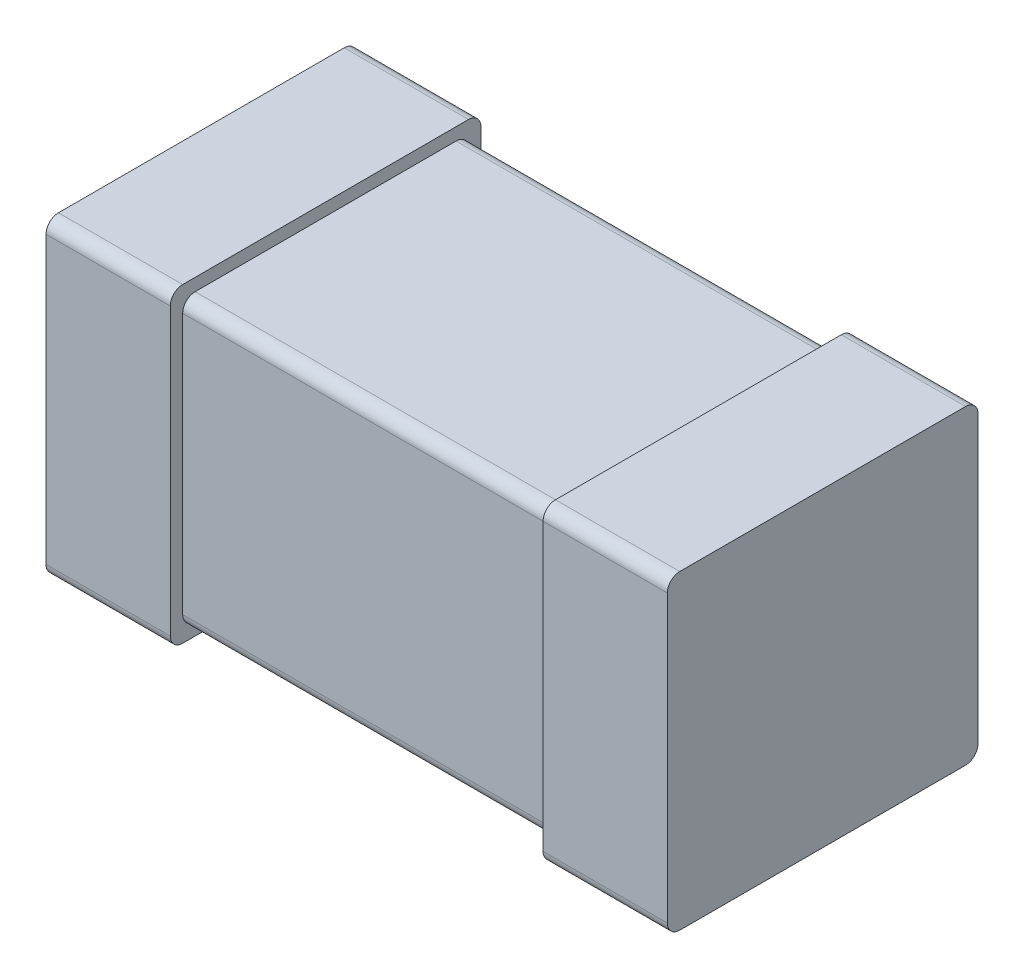
ISO-10303-21;
HEADER;
FILE_DESCRIPTION(('STEP AP214'),'2;1');
FILE_NAME('part.step','',(''),(''),'','','');
FILE_SCHEMA(('AUTOMOTIVE_DESIGN { 1 0 10303 214 1 1 1 1 }'));
ENDSEC;
DATA;
#1=APPLICATION_CONTEXT('core data for automotive mechanical design processes');
#2=APPLICATION_PROTOCOL_DEFINITION('international standard','automotive_design',2000,#1);
#3=PRODUCT_CONTEXT('',#1,'mechanical');
#4=PRODUCT('Part','Part','',(#3));
#5=PRODUCT_RELATED_PRODUCT_CATEGORY('part','',(#4));
#6=PRODUCT_DEFINITION_FORMATION('','',#4);
#7=PRODUCT_DEFINITION_CONTEXT('part definition',#1,'design');
#8=PRODUCT_DEFINITION('design','',#6,#7);
#9=PRODUCT_DEFINITION_SHAPE('','',#8);
#10=(LENGTH_UNIT() NAMED_UNIT(*) SI_UNIT(.MILLI.,.METRE.));
#11=(NAMED_UNIT(*) PLANE_ANGLE_UNIT() SI_UNIT($,.RADIAN.));
#12=(NAMED_UNIT(*) SI_UNIT($,.STERADIAN.) SOLID_ANGLE_UNIT());
#13=UNCERTAINTY_MEASURE_WITH_UNIT(LENGTH_MEASURE(1.E-05),#10,'distance_accuracy_value','');
#14=(GEOMETRIC_REPRESENTATION_CONTEXT(3) GLOBAL_UNCERTAINTY_ASSIGNED_CONTEXT((#13)) GLOBAL_UNIT_ASSIGNED_CONTEXT((#10,
#11,#12)) REPRESENTATION_CONTEXT('',''));
#15=CARTESIAN_POINT('',(0.,0.,0.));
#16=DIRECTION('',(0.,0.,1.));
#17=DIRECTION('',(1.,0.,0.));
#18=AXIS2_PLACEMENT_3D('',#15,#16,#17);
#19=CARTESIAN_POINT('',(-0.5,-0.25,0.));
#20=DIRECTION('',(1.,0.,0.));
#21=DIRECTION('',(0.,0.,1.));
#22=AXIS2_PLACEMENT_3D('',#19,#20,#21);
#23=PLANE('',#22);
#24=CARTESIAN_POINT('',(-0.5,-0.23,0.48));
#25=DIRECTION('',(-1.,0.,0.));
#26=DIRECTION('',(0.,0.,1.));
#27=AXIS2_PLACEMENT_3D('',#24,#25,#26);
#28=CIRCLE('',#27,0.02);
#29=CARTESIAN_POINT('',(-0.5,-0.25,0.48));
#30=VERTEX_POINT('',#29);
#31=CARTESIAN_POINT('',(-0.5,-0.23,0.5));
#32=VERTEX_POINT('',#31);
#33=EDGE_CURVE('E11',#30,#32,#28,.T.);
#34=ORIENTED_EDGE('',*,*,#33,.T.);
#35=DIRECTION('',(0.,1.,0.));
#36=VECTOR('',#35,1.);
#37=CARTESIAN_POINT('',(-0.5,-0.25,0.5));
#38=LINE('',#37,#36);
#39=CARTESIAN_POINT('',(-0.5,0.23,0.5));
#40=VERTEX_POINT('',#39);
#41=EDGE_CURVE('E25',#32,#40,#38,.T.);
#42=ORIENTED_EDGE('',*,*,#41,.T.);
#43=CARTESIAN_POINT('',(-0.5,0.23,0.48));
#44=DIRECTION('',(1.,0.,0.));
#45=DIRECTION('',(0.,0.,1.));
#46=AXIS2_PLACEMENT_3D('',#43,#44,#45);
#47=CIRCLE('',#46,0.02);
#48=CARTESIAN_POINT('',(-0.5,0.25,0.48));
#49=VERTEX_POINT('',#48);
#50=EDGE_CURVE('E450',#49,#40,#47,.T.);
#51=ORIENTED_EDGE('',*,*,#50,.F.);
#52=DIRECTION('',(0.,0.,1.));
#53=VECTOR('',#52,1.);
#54=CARTESIAN_POINT('',(-0.5,0.25,0.));
#55=LINE('',#54,#53);
#56=CARTESIAN_POINT('',(-0.5,0.25,0.02));
#57=VERTEX_POINT('',#56);
#58=EDGE_CURVE('E445',#57,#49,#55,.T.);
#59=ORIENTED_EDGE('',*,*,#58,.F.);
#60=CARTESIAN_POINT('',(-0.5,0.23,0.02));
#61=DIRECTION('',(-1.,0.,0.));
#62=DIRECTION('',(0.,0.,1.));
#63=AXIS2_PLACEMENT_3D('',#60,#61,#62);
#64=CIRCLE('',#63,0.02);
#65=CARTESIAN_POINT('',(-0.5,0.23,0.));
#66=VERTEX_POINT('',#65);
#67=EDGE_CURVE('E441',#57,#66,#64,.T.);
#68=ORIENTED_EDGE('',*,*,#67,.T.);
#69=DIRECTION('',(0.,1.,0.));
#70=VECTOR('',#69,1.);
#71=CARTESIAN_POINT('',(-0.5,-0.25,0.));
#72=LINE('',#71,#70);
#73=CARTESIAN_POINT('',(-0.5,-0.23,0.));
#74=VERTEX_POINT('',#73);
#75=EDGE_CURVE('E436',#74,#66,#72,.T.);
#76=ORIENTED_EDGE('',*,*,#75,.F.);
#77=CARTESIAN_POINT('',(-0.5,-0.23,0.02));
#78=DIRECTION('',(1.,0.,0.));
#79=DIRECTION('',(0.,0.,1.));
#80=AXIS2_PLACEMENT_3D('',#77,#78,#79);
#81=CIRCLE('',#80,0.02);
#82=CARTESIAN_POINT('',(-0.5,-0.25,0.02));
#83=VERTEX_POINT('',#82);
#84=EDGE_CURVE('E431',#83,#74,#81,.T.);
#85=ORIENTED_EDGE('',*,*,#84,.F.);
#86=DIRECTION('',(0.,0.,1.));
#87=VECTOR('',#86,1.);
#88=CARTESIAN_POINT('',(-0.5,-0.25,0.));
#89=LINE('',#88,#87);
#90=EDGE_CURVE('E427',#83,#30,#89,.T.);
#91=ORIENTED_EDGE('',*,*,#90,.T.);
#92=EDGE_LOOP('',(#34,#42,#51,#59,#68,#76,#85,#91));
#93=FACE_BOUND('',#92,.T.);
#94=ADVANCED_FACE('F17',(#93),#23,.F.);
#95=CARTESIAN_POINT('',(-0.5,-0.25,0.));
#96=DIRECTION('',(0.,1.,0.));
#97=DIRECTION('',(0.,0.,1.));
#98=AXIS2_PLACEMENT_3D('',#95,#96,#97);
#99=PLANE('',#98);
#100=DIRECTION('',(1.,0.,0.));
#101=VECTOR('',#100,1.);
#102=CARTESIAN_POINT('',(-0.5,-0.25,0.48));
#103=LINE('',#102,#101);
#104=CARTESIAN_POINT('',(-0.3,-0.25,0.48));
#105=VERTEX_POINT('',#104);
#106=EDGE_CURVE('E422',#30,#105,#103,.T.);
#107=ORIENTED_EDGE('',*,*,#106,.F.);
#108=ORIENTED_EDGE('',*,*,#90,.F.);
#109=DIRECTION('',(1.,0.,0.));
#110=VECTOR('',#109,1.);
#111=CARTESIAN_POINT('',(-0.5,-0.25,0.02));
#112=LINE('',#111,#110);
#113=CARTESIAN_POINT('',(-0.3,-0.25,0.02));
#114=VERTEX_POINT('',#113);
#115=EDGE_CURVE('E418',#83,#114,#112,.T.);
#116=ORIENTED_EDGE('',*,*,#115,.T.);
#117=DIRECTION('',(0.,0.,1.));
#118=VECTOR('',#117,1.);
#119=CARTESIAN_POINT('',(-0.3,-0.25,0.));
#120=LINE('',#119,#118);
#121=EDGE_CURVE('E414',#114,#105,#120,.T.);
#122=ORIENTED_EDGE('',*,*,#121,.T.);
#123=EDGE_LOOP('',(#107,#108,#116,#122));
#124=FACE_BOUND('',#123,.T.);
#125=ADVANCED_FACE('F495',(#124),#99,.F.);
#126=CARTESIAN_POINT('',(-0.3,-0.25,0.));
#127=DIRECTION('',(1.,0.,0.));
#128=DIRECTION('',(0.,0.,1.));
#129=AXIS2_PLACEMENT_3D('',#126,#127,#128);
#130=PLANE('',#129);
#131=ORIENTED_EDGE('',*,*,#121,.F.);
#132=CARTESIAN_POINT('',(-0.3,-0.23,0.02));
#133=DIRECTION('',(1.,0.,0.));
#134=DIRECTION('',(0.,0.,1.));
#135=AXIS2_PLACEMENT_3D('',#132,#133,#134);
#136=CIRCLE('',#135,0.02);
#137=CARTESIAN_POINT('',(-0.3,-0.23,0.));
#138=VERTEX_POINT('',#137);
#139=EDGE_CURVE('E410',#114,#138,#136,.T.);
#140=ORIENTED_EDGE('',*,*,#139,.T.);
#141=DIRECTION('',(0.,1.,0.));
#142=VECTOR('',#141,1.);
#143=CARTESIAN_POINT('',(-0.3,-0.25,0.));
#144=LINE('',#143,#142);
#145=CARTESIAN_POINT('',(-0.3,0.23,0.));
#146=VERTEX_POINT('',#145);
#147=EDGE_CURVE('E406',#138,#146,#144,.T.);
#148=ORIENTED_EDGE('',*,*,#147,.T.);
#149=CARTESIAN_POINT('',(-0.3,0.23,0.02));
#150=DIRECTION('',(-1.,0.,0.));
#151=DIRECTION('',(0.,0.,1.));
#152=AXIS2_PLACEMENT_3D('',#149,#150,#151);
#153=CIRCLE('',#152,0.02);
#154=CARTESIAN_POINT('',(-0.3,0.25,0.02));
#155=VERTEX_POINT('',#154);
#156=EDGE_CURVE('E401',#155,#146,#153,.T.);
#157=ORIENTED_EDGE('',*,*,#156,.F.);
#158=DIRECTION('',(0.,0.,1.));
#159=VECTOR('',#158,1.);
#160=CARTESIAN_POINT('',(-0.3,0.25,0.));
#161=LINE('',#160,#159);
#162=CARTESIAN_POINT('',(-0.3,0.25,0.48));
#163=VERTEX_POINT('',#162);
#164=EDGE_CURVE('E397',#155,#163,#161,.T.);
#165=ORIENTED_EDGE('',*,*,#164,.T.);
#166=CARTESIAN_POINT('',(-0.3,0.23,0.48));
#167=DIRECTION('',(1.,0.,0.));
#168=DIRECTION('',(0.,0.,1.));
#169=AXIS2_PLACEMENT_3D('',#166,#167,#168);
#170=CIRCLE('',#169,0.02);
#171=CARTESIAN_POINT('',(-0.3,0.23,0.5));
#172=VERTEX_POINT('',#171);
#173=EDGE_CURVE('E393',#163,#172,#170,.T.);
#174=ORIENTED_EDGE('',*,*,#173,.T.);
#175=DIRECTION('',(0.,1.,0.));
#176=VECTOR('',#175,1.);
#177=CARTESIAN_POINT('',(-0.3,-0.25,0.5));
#178=LINE('',#177,#176);
#179=CARTESIAN_POINT('',(-0.3,-0.23,0.5));
#180=VERTEX_POINT('',#179);
#181=EDGE_CURVE('E388',#180,#172,#178,.T.);
#182=ORIENTED_EDGE('',*,*,#181,.F.);
#183=CARTESIAN_POINT('',(-0.3,-0.23,0.48));
#184=DIRECTION('',(-1.,0.,0.));
#185=DIRECTION('',(0.,0.,1.));
#186=AXIS2_PLACEMENT_3D('',#183,#184,#185);
#187=CIRCLE('',#186,0.02);
#188=EDGE_CURVE('E383',#105,#180,#187,.T.);
#189=ORIENTED_EDGE('',*,*,#188,.F.);
#190=EDGE_LOOP('',(#131,#140,#148,#157,#165,#174,#182,#189));
#191=FACE_BOUND('',#190,.T.);
#192=CARTESIAN_POINT('',(-0.3,-0.21,0.04));
#193=DIRECTION('',(1.,0.,0.));
#194=DIRECTION('',(0.,0.,1.));
#195=AXIS2_PLACEMENT_3D('',#192,#193,#194);
#196=CIRCLE('',#195,0.02);
#197=CARTESIAN_POINT('',(-0.3,-0.23,0.04));
#198=VERTEX_POINT('',#197);
#199=CARTESIAN_POINT('',(-0.3,-0.21,0.02));
#200=VERTEX_POINT('',#199);
#201=EDGE_CURVE('E378',#198,#200,#196,.T.);
#202=ORIENTED_EDGE('',*,*,#201,.F.);
#203=DIRECTION('',(0.,0.,1.));
#204=VECTOR('',#203,1.);
#205=CARTESIAN_POINT('',(-0.3,-0.23,0.02));
#206=LINE('',#205,#204);
#207=CARTESIAN_POINT('',(-0.3,-0.23,0.46));
#208=VERTEX_POINT('',#207);
#209=EDGE_CURVE('E374',#198,#208,#206,.T.);
#210=ORIENTED_EDGE('',*,*,#209,.T.);
#211=CARTESIAN_POINT('',(-0.3,-0.21,0.46));
#212=DIRECTION('',(-1.,0.,0.));
#213=DIRECTION('',(0.,0.,1.));
#214=AXIS2_PLACEMENT_3D('',#211,#212,#213);
#215=CIRCLE('',#214,0.02);
#216=CARTESIAN_POINT('',(-0.3,-0.21,0.48));
#217=VERTEX_POINT('',#216);
#218=EDGE_CURVE('E370',#208,#217,#215,.T.);
#219=ORIENTED_EDGE('',*,*,#218,.T.);
#220=DIRECTION('',(0.,1.,0.));
#221=VECTOR('',#220,1.);
#222=CARTESIAN_POINT('',(-0.3,-0.23,0.48));
#223=LINE('',#222,#221);
#224=CARTESIAN_POINT('',(-0.3,0.21,0.48));
#225=VERTEX_POINT('',#224);
#226=EDGE_CURVE('E366',#217,#225,#223,.T.);
#227=ORIENTED_EDGE('',*,*,#226,.T.);
#228=CARTESIAN_POINT('',(-0.3,0.21,0.46));
#229=DIRECTION('',(1.,0.,0.));
#230=DIRECTION('',(0.,0.,1.));
#231=AXIS2_PLACEMENT_3D('',#228,#229,#230);
#232=CIRCLE('',#231,0.02);
#233=CARTESIAN_POINT('',(-0.3,0.23,0.46));
#234=VERTEX_POINT('',#233);
#235=EDGE_CURVE('E361',#234,#225,#232,.T.);
#236=ORIENTED_EDGE('',*,*,#235,.F.);
#237=DIRECTION('',(0.,0.,1.));
#238=VECTOR('',#237,1.);
#239=CARTESIAN_POINT('',(-0.3,0.23,0.02));
#240=LINE('',#239,#238);
#241=CARTESIAN_POINT('',(-0.3,0.23,0.04));
#242=VERTEX_POINT('',#241);
#243=EDGE_CURVE('E356',#242,#234,#240,.T.);
#244=ORIENTED_EDGE('',*,*,#243,.F.);
#245=CARTESIAN_POINT('',(-0.3,0.21,0.04));
#246=DIRECTION('',(-1.,0.,0.));
#247=DIRECTION('',(0.,0.,1.));
#248=AXIS2_PLACEMENT_3D('',#245,#246,#247);
#249=CIRCLE('',#248,0.02);
#250=CARTESIAN_POINT('',(-0.3,0.21,0.02));
#251=VERTEX_POINT('',#250);
#252=EDGE_CURVE('E352',#242,#251,#249,.T.);
#253=ORIENTED_EDGE('',*,*,#252,.T.);
#254=DIRECTION('',(0.,1.,0.));
#255=VECTOR('',#254,1.);
#256=CARTESIAN_POINT('',(-0.3,-0.23,0.02));
#257=LINE('',#256,#255);
#258=EDGE_CURVE('E347',#200,#251,#257,.T.);
#259=ORIENTED_EDGE('',*,*,#258,.F.);
#260=EDGE_LOOP('',(#202,#210,#219,#227,#236,#244,#253,#259));
#261=FACE_BOUND('',#260,.T.);
#262=ADVANCED_FACE('F573',(#191,#261),#130,.T.);
#263=CARTESIAN_POINT('',(-0.3,-0.23,0.02));
#264=DIRECTION('',(0.,0.,1.));
#265=DIRECTION('',(1.,0.,0.));
#266=AXIS2_PLACEMENT_3D('',#263,#264,#265);
#267=PLANE('',#266);
#268=DIRECTION('',(1.,0.,0.));
#269=VECTOR('',#268,1.);
#270=CARTESIAN_POINT('',(-0.3,0.21,0.02));
#271=LINE('',#270,#269);
#272=CARTESIAN_POINT('',(0.3,0.21,0.02));
#273=VERTEX_POINT('',#272);
#274=EDGE_CURVE('E343',#251,#273,#271,.T.);
#275=ORIENTED_EDGE('',*,*,#274,.T.);
#276=DIRECTION('',(0.,1.,0.));
#277=VECTOR('',#276,1.);
#278=CARTESIAN_POINT('',(0.3,-0.23,0.02));
#279=LINE('',#278,#277);
#280=CARTESIAN_POINT('',(0.3,-0.21,0.02));
#281=VERTEX_POINT('',#280);
#282=EDGE_CURVE('E338',#281,#273,#279,.T.);
#283=ORIENTED_EDGE('',*,*,#282,.F.);
#284=DIRECTION('',(1.,0.,0.));
#285=VECTOR('',#284,1.);
#286=CARTESIAN_POINT('',(-0.3,-0.21,0.02));
#287=LINE('',#286,#285);
#288=EDGE_CURVE('E333',#200,#281,#287,.T.);
#289=ORIENTED_EDGE('',*,*,#288,.F.);
#290=ORIENTED_EDGE('',*,*,#258,.T.);
#291=EDGE_LOOP('',(#275,#283,#289,#290));
#292=FACE_BOUND('',#291,.T.);
#293=ADVANCED_FACE('F577',(#292),#267,.F.);
#294=CARTESIAN_POINT('',(-0.3,-0.21,0.04));
#295=DIRECTION('',(1.,0.,0.));
#296=DIRECTION('',(0.,0.707106781186547,0.707106781186548));
#297=AXIS2_PLACEMENT_3D('',#294,#295,#296);
#298=CYLINDRICAL_SURFACE('',#297,0.02);
#299=ORIENTED_EDGE('',*,*,#201,.T.);
#300=ORIENTED_EDGE('',*,*,#288,.T.);
#301=CARTESIAN_POINT('',(0.3,-0.21,0.04));
#302=DIRECTION('',(1.,0.,0.));
#303=DIRECTION('',(0.,0.,1.));
#304=AXIS2_PLACEMENT_3D('',#301,#302,#303);
#305=CIRCLE('',#304,0.02);
#306=CARTESIAN_POINT('',(0.3,-0.23,0.04));
#307=VERTEX_POINT('',#306);
#308=EDGE_CURVE('E328',#307,#281,#305,.T.);
#309=ORIENTED_EDGE('',*,*,#308,.F.);
#310=DIRECTION('',(1.,0.,0.));
#311=VECTOR('',#310,1.);
#312=CARTESIAN_POINT('',(-0.3,-0.23,0.04));
#313=LINE('',#312,#311);
#314=EDGE_CURVE('E323',#198,#307,#313,.T.);
#315=ORIENTED_EDGE('',*,*,#314,.F.);
#316=EDGE_LOOP('',(#299,#300,#309,#315));
#317=FACE_BOUND('',#316,.T.);
#318=ADVANCED_FACE('F583',(#317),#298,.T.);
#319=CARTESIAN_POINT('',(-0.3,-0.23,0.02));
#320=DIRECTION('',(0.,1.,0.));
#321=DIRECTION('',(0.,0.,1.));
#322=AXIS2_PLACEMENT_3D('',#319,#320,#321);
#323=PLANE('',#322);
#324=DIRECTION('',(1.,0.,0.));
#325=VECTOR('',#324,1.);
#326=CARTESIAN_POINT('',(-0.3,-0.23,0.46));
#327=LINE('',#326,#325);
#328=CARTESIAN_POINT('',(0.3,-0.23,0.46));
#329=VERTEX_POINT('',#328);
#330=EDGE_CURVE('E318',#208,#329,#327,.T.);
#331=ORIENTED_EDGE('',*,*,#330,.F.);
#332=ORIENTED_EDGE('',*,*,#209,.F.);
#333=ORIENTED_EDGE('',*,*,#314,.T.);
#334=DIRECTION('',(0.,0.,1.));
#335=VECTOR('',#334,1.);
#336=CARTESIAN_POINT('',(0.3,-0.23,0.02));
#337=LINE('',#336,#335);
#338=EDGE_CURVE('E314',#307,#329,#337,.T.);
#339=ORIENTED_EDGE('',*,*,#338,.T.);
#340=EDGE_LOOP('',(#331,#332,#333,#339));
#341=FACE_BOUND('',#340,.T.);
#342=ADVANCED_FACE('F587',(#341),#323,.F.);
#343=CARTESIAN_POINT('',(0.3,-0.25,0.));
#344=DIRECTION('',(1.,0.,0.));
#345=DIRECTION('',(0.,0.,1.));
#346=AXIS2_PLACEMENT_3D('',#343,#344,#345);
#347=PLANE('',#346);
#348=CARTESIAN_POINT('',(0.3,-0.23,0.48));
#349=DIRECTION('',(-1.,0.,0.));
#350=DIRECTION('',(0.,0.,1.));
#351=AXIS2_PLACEMENT_3D('',#348,#349,#350);
#352=CIRCLE('',#351,0.02);
#353=CARTESIAN_POINT('',(0.3,-0.25,0.48));
#354=VERTEX_POINT('',#353);
#355=CARTESIAN_POINT('',(0.3,-0.23,0.5));
#356=VERTEX_POINT('',#355);
#357=EDGE_CURVE('E310',#354,#356,#352,.T.);
#358=ORIENTED_EDGE('',*,*,#357,.T.);
#359=DIRECTION('',(0.,1.,0.));
#360=VECTOR('',#359,1.);
#361=CARTESIAN_POINT('',(0.3,-0.25,0.5));
#362=LINE('',#361,#360);
#363=CARTESIAN_POINT('',(0.3,0.23,0.5));
#364=VERTEX_POINT('',#363);
#365=EDGE_CURVE('E191',#356,#364,#362,.T.);
#366=ORIENTED_EDGE('',*,*,#365,.T.);
#367=CARTESIAN_POINT('',(0.3,0.23,0.48));
#368=DIRECTION('',(1.,0.,0.));
#369=DIRECTION('',(0.,0.,1.));
#370=AXIS2_PLACEMENT_3D('',#367,#368,#369);
#371=CIRCLE('',#370,0.02);
#372=CARTESIAN_POINT('',(0.3,0.25,0.48));
#373=VERTEX_POINT('',#372);
#374=EDGE_CURVE('E302',#373,#364,#371,.T.);
#375=ORIENTED_EDGE('',*,*,#374,.F.);
#376=DIRECTION('',(0.,0.,1.));
#377=VECTOR('',#376,1.);
#378=CARTESIAN_POINT('',(0.3,0.25,0.));
#379=LINE('',#378,#377);
#380=CARTESIAN_POINT('',(0.3,0.25,0.02));
#381=VERTEX_POINT('',#380);
#382=EDGE_CURVE('E297',#381,#373,#379,.T.);
#383=ORIENTED_EDGE('',*,*,#382,.F.);
#384=CARTESIAN_POINT('',(0.3,0.23,0.02));
#385=DIRECTION('',(-1.,0.,0.));
#386=DIRECTION('',(0.,0.,1.));
#387=AXIS2_PLACEMENT_3D('',#384,#385,#386);
#388=CIRCLE('',#387,0.02);
#389=CARTESIAN_POINT('',(0.3,0.23,0.));
#390=VERTEX_POINT('',#389);
#391=EDGE_CURVE('E293',#381,#390,#388,.T.);
#392=ORIENTED_EDGE('',*,*,#391,.T.);
#393=DIRECTION('',(0.,1.,0.));
#394=VECTOR('',#393,1.);
#395=CARTESIAN_POINT('',(0.3,-0.25,0.));
#396=LINE('',#395,#394);
#397=CARTESIAN_POINT('',(0.3,-0.23,0.));
#398=VERTEX_POINT('',#397);
#399=EDGE_CURVE('E288',#398,#390,#396,.T.);
#400=ORIENTED_EDGE('',*,*,#399,.F.);
#401=CARTESIAN_POINT('',(0.3,-0.23,0.02));
#402=DIRECTION('',(1.,0.,0.));
#403=DIRECTION('',(0.,0.,1.));
#404=AXIS2_PLACEMENT_3D('',#401,#402,#403);
#405=CIRCLE('',#404,0.02);
#406=CARTESIAN_POINT('',(0.3,-0.25,0.02));
#407=VERTEX_POINT('',#406);
#408=EDGE_CURVE('E283',#407,#398,#405,.T.);
#409=ORIENTED_EDGE('',*,*,#408,.F.);
#410=DIRECTION('',(0.,0.,1.));
#411=VECTOR('',#410,1.);
#412=CARTESIAN_POINT('',(0.3,-0.25,0.));
#413=LINE('',#412,#411);
#414=EDGE_CURVE('E279',#407,#354,#413,.T.);
#415=ORIENTED_EDGE('',*,*,#414,.T.);
#416=EDGE_LOOP('',(#358,#366,#375,#383,#392,#400,#409,#415));
#417=FACE_BOUND('',#416,.T.);
#418=ORIENTED_EDGE('',*,*,#282,.T.);
#419=CARTESIAN_POINT('',(0.3,0.21,0.04));
#420=DIRECTION('',(-1.,0.,0.));
#421=DIRECTION('',(0.,0.,1.));
#422=AXIS2_PLACEMENT_3D('',#419,#420,#421);
#423=CIRCLE('',#422,0.02);
#424=CARTESIAN_POINT('',(0.3,0.23,0.04));
#425=VERTEX_POINT('',#424);
#426=EDGE_CURVE('E274',#425,#273,#423,.T.);
#427=ORIENTED_EDGE('',*,*,#426,.F.);
#428=DIRECTION('',(0.,0.,1.));
#429=VECTOR('',#428,1.);
#430=CARTESIAN_POINT('',(0.3,0.23,0.02));
#431=LINE('',#430,#429);
#432=CARTESIAN_POINT('',(0.3,0.23,0.46));
#433=VERTEX_POINT('',#432);
#434=EDGE_CURVE('E270',#425,#433,#431,.T.);
#435=ORIENTED_EDGE('',*,*,#434,.T.);
#436=CARTESIAN_POINT('',(0.3,0.21,0.46));
#437=DIRECTION('',(1.,0.,0.));
#438=DIRECTION('',(0.,0.,1.));
#439=AXIS2_PLACEMENT_3D('',#436,#437,#438);
#440=CIRCLE('',#439,0.02);
#441=CARTESIAN_POINT('',(0.3,0.21,0.48));
#442=VERTEX_POINT('',#441);
#443=EDGE_CURVE('E266',#433,#442,#440,.T.);
#444=ORIENTED_EDGE('',*,*,#443,.T.);
#445=DIRECTION('',(0.,1.,0.));
#446=VECTOR('',#445,1.);
#447=CARTESIAN_POINT('',(0.3,-0.23,0.48));
#448=LINE('',#447,#446);
#449=CARTESIAN_POINT('',(0.3,-0.21,0.48));
#450=VERTEX_POINT('',#449);
#451=EDGE_CURVE('E261',#450,#442,#448,.T.);
#452=ORIENTED_EDGE('',*,*,#451,.F.);
#453=CARTESIAN_POINT('',(0.3,-0.21,0.46));
#454=DIRECTION('',(-1.,0.,0.));
#455=DIRECTION('',(0.,0.,1.));
#456=AXIS2_PLACEMENT_3D('',#453,#454,#455);
#457=CIRCLE('',#456,0.02);
#458=EDGE_CURVE('E256',#329,#450,#457,.T.);
#459=ORIENTED_EDGE('',*,*,#458,.F.);
#460=ORIENTED_EDGE('',*,*,#338,.F.);
#461=ORIENTED_EDGE('',*,*,#308,.T.);
#462=EDGE_LOOP('',(#418,#427,#435,#444,#452,#459,#460,#461));
#463=FACE_BOUND('',#462,.T.);
#464=ADVANCED_FACE('F539',(#417,#463),#347,.F.);
#465=CARTESIAN_POINT('',(-0.3,-0.21,0.46));
#466=DIRECTION('',(1.,0.,0.));
#467=DIRECTION('',(0.,0.707106781186547,-0.707106781186548));
#468=AXIS2_PLACEMENT_3D('',#465,#466,#467);
#469=CYLINDRICAL_SURFACE('',#468,0.02);
#470=ORIENTED_EDGE('',*,*,#330,.T.);
#471=ORIENTED_EDGE('',*,*,#458,.T.);
#472=DIRECTION('',(1.,0.,0.));
#473=VECTOR('',#472,1.);
#474=CARTESIAN_POINT('',(-0.3,-0.21,0.48));
#475=LINE('',#474,#473);
#476=EDGE_CURVE('E251',#217,#450,#475,.T.);
#477=ORIENTED_EDGE('',*,*,#476,.F.);
#478=ORIENTED_EDGE('',*,*,#218,.F.);
#479=EDGE_LOOP('',(#470,#471,#477,#478));
#480=FACE_BOUND('',#479,.T.);
#481=ADVANCED_FACE('F594',(#480),#469,.T.);
#482=CARTESIAN_POINT('',(-0.3,-0.23,0.48));
#483=DIRECTION('',(0.,0.,1.));
#484=DIRECTION('',(1.,0.,0.));
#485=AXIS2_PLACEMENT_3D('',#482,#483,#484);
#486=PLANE('',#485);
#487=ORIENTED_EDGE('',*,*,#226,.F.);
#488=ORIENTED_EDGE('',*,*,#476,.T.);
#489=ORIENTED_EDGE('',*,*,#451,.T.);
#490=DIRECTION('',(1.,0.,0.));
#491=VECTOR('',#490,1.);
#492=CARTESIAN_POINT('',(-0.3,0.21,0.48));
#493=LINE('',#492,#491);
#494=EDGE_CURVE('E246',#225,#442,#493,.T.);
#495=ORIENTED_EDGE('',*,*,#494,.F.);
#496=EDGE_LOOP('',(#487,#488,#489,#495));
#497=FACE_BOUND('',#496,.T.);
#498=ADVANCED_FACE('F597',(#497),#486,.T.);
#499=CARTESIAN_POINT('',(-0.3,0.21,0.46));
#500=DIRECTION('',(1.,0.,0.));
#501=DIRECTION('',(0.,-0.707106781186547,-0.707106781186548));
#502=AXIS2_PLACEMENT_3D('',#499,#500,#501);
#503=CYLINDRICAL_SURFACE('',#502,0.02);
#504=ORIENTED_EDGE('',*,*,#235,.T.);
#505=ORIENTED_EDGE('',*,*,#494,.T.);
#506=ORIENTED_EDGE('',*,*,#443,.F.);
#507=DIRECTION('',(1.,0.,0.));
#508=VECTOR('',#507,1.);
#509=CARTESIAN_POINT('',(-0.3,0.23,0.46));
#510=LINE('',#509,#508);
#511=EDGE_CURVE('E241',#234,#433,#510,.T.);
#512=ORIENTED_EDGE('',*,*,#511,.F.);
#513=EDGE_LOOP('',(#504,#505,#506,#512));
#514=FACE_BOUND('',#513,.T.);
#515=ADVANCED_FACE('F601',(#514),#503,.T.);
#516=CARTESIAN_POINT('',(-0.3,0.23,0.02));
#517=DIRECTION('',(0.,1.,0.));
#518=DIRECTION('',(0.,0.,1.));
#519=AXIS2_PLACEMENT_3D('',#516,#517,#518);
#520=PLANE('',#519);
#521=ORIENTED_EDGE('',*,*,#434,.F.);
#522=DIRECTION('',(1.,0.,0.));
#523=VECTOR('',#522,1.);
#524=CARTESIAN_POINT('',(-0.3,0.23,0.04));
#525=LINE('',#524,#523);
#526=EDGE_CURVE('E236',#242,#425,#525,.T.);
#527=ORIENTED_EDGE('',*,*,#526,.F.);
#528=ORIENTED_EDGE('',*,*,#243,.T.);
#529=ORIENTED_EDGE('',*,*,#511,.T.);
#530=EDGE_LOOP('',(#521,#527,#528,#529));
#531=FACE_BOUND('',#530,.T.);
#532=ADVANCED_FACE('F605',(#531),#520,.T.);
#533=CARTESIAN_POINT('',(-0.3,0.21,0.04));
#534=DIRECTION('',(1.,0.,0.));
#535=DIRECTION('',(0.,-0.707106781186547,0.707106781186548));
#536=AXIS2_PLACEMENT_3D('',#533,#534,#535);
#537=CYLINDRICAL_SURFACE('',#536,0.02);
#538=ORIENTED_EDGE('',*,*,#526,.T.);
#539=ORIENTED_EDGE('',*,*,#426,.T.);
#540=ORIENTED_EDGE('',*,*,#274,.F.);
#541=ORIENTED_EDGE('',*,*,#252,.F.);
#542=EDGE_LOOP('',(#538,#539,#540,#541));
#543=FACE_BOUND('',#542,.T.);
#544=ADVANCED_FACE('F609',(#543),#537,.T.);
#545=CARTESIAN_POINT('',(0.3,-0.25,0.));
#546=DIRECTION('',(0.,1.,0.));
#547=DIRECTION('',(0.,0.,1.));
#548=AXIS2_PLACEMENT_3D('',#545,#546,#547);
#549=PLANE('',#548);
#550=DIRECTION('',(1.,0.,0.));
#551=VECTOR('',#550,1.);
#552=CARTESIAN_POINT('',(0.3,-0.25,0.48));
#553=LINE('',#552,#551);
#554=CARTESIAN_POINT('',(0.5,-0.25,0.48));
#555=VERTEX_POINT('',#554);
#556=EDGE_CURVE('E198',#354,#555,#553,.T.);
#557=ORIENTED_EDGE('',*,*,#556,.F.);
#558=ORIENTED_EDGE('',*,*,#414,.F.);
#559=DIRECTION('',(1.,0.,0.));
#560=VECTOR('',#559,1.);
#561=CARTESIAN_POINT('',(0.3,-0.25,0.02));
#562=LINE('',#561,#560);
#563=CARTESIAN_POINT('',(0.5,-0.25,0.02));
#564=VERTEX_POINT('',#563);
#565=EDGE_CURVE('E229',#407,#564,#562,.T.);
#566=ORIENTED_EDGE('',*,*,#565,.T.);
#567=DIRECTION('',(0.,0.,1.));
#568=VECTOR('',#567,1.);
#569=CARTESIAN_POINT('',(0.5,-0.25,0.));
#570=LINE('',#569,#568);
#571=EDGE_CURVE('E225',#564,#555,#570,.T.);
#572=ORIENTED_EDGE('',*,*,#571,.T.);
#573=EDGE_LOOP('',(#557,#558,#566,#572));
#574=FACE_BOUND('',#573,.T.);
#575=ADVANCED_FACE('F545',(#574),#549,.F.);
#576=CARTESIAN_POINT('',(0.5,-0.25,0.));
#577=DIRECTION('',(1.,0.,0.));
#578=DIRECTION('',(0.,0.,1.));
#579=AXIS2_PLACEMENT_3D('',#576,#577,#578);
#580=PLANE('',#579);
#581=ORIENTED_EDGE('',*,*,#571,.F.);
#582=CARTESIAN_POINT('',(0.5,-0.23,0.02));
#583=DIRECTION('',(1.,0.,0.));
#584=DIRECTION('',(0.,0.,1.));
#585=AXIS2_PLACEMENT_3D('',#582,#583,#584);
#586=CIRCLE('',#585,0.02);
#587=CARTESIAN_POINT('',(0.5,-0.23,0.));
#588=VERTEX_POINT('',#587);
#589=EDGE_CURVE('E221',#564,#588,#586,.T.);
#590=ORIENTED_EDGE('',*,*,#589,.T.);
#591=DIRECTION('',(0.,1.,0.));
#592=VECTOR('',#591,1.);
#593=CARTESIAN_POINT('',(0.5,-0.25,0.));
#594=LINE('',#593,#592);
#595=CARTESIAN_POINT('',(0.5,0.23,0.));
#596=VERTEX_POINT('',#595);
#597=EDGE_CURVE('E217',#588,#596,#594,.T.);
#598=ORIENTED_EDGE('',*,*,#597,.T.);
#599=CARTESIAN_POINT('',(0.5,0.23,0.02));
#600=DIRECTION('',(-1.,0.,0.));
#601=DIRECTION('',(0.,0.,1.));
#602=AXIS2_PLACEMENT_3D('',#599,#600,#601);
#603=CIRCLE('',#602,0.02);
#604=CARTESIAN_POINT('',(0.5,0.25,0.02));
#605=VERTEX_POINT('',#604);
#606=EDGE_CURVE('E212',#605,#596,#603,.T.);
#607=ORIENTED_EDGE('',*,*,#606,.F.);
#608=DIRECTION('',(0.,0.,1.));
#609=VECTOR('',#608,1.);
#610=CARTESIAN_POINT('',(0.5,0.25,0.));
#611=LINE('',#610,#609);
#612=CARTESIAN_POINT('',(0.5,0.25,0.48));
#613=VERTEX_POINT('',#612);
#614=EDGE_CURVE('E208',#605,#613,#611,.T.);
#615=ORIENTED_EDGE('',*,*,#614,.T.);
#616=CARTESIAN_POINT('',(0.5,0.23,0.48));
#617=DIRECTION('',(1.,0.,0.));
#618=DIRECTION('',(0.,0.,1.));
#619=AXIS2_PLACEMENT_3D('',#616,#617,#618);
#620=CIRCLE('',#619,0.02);
#621=CARTESIAN_POINT('',(0.5,0.23,0.5));
#622=VERTEX_POINT('',#621);
#623=EDGE_CURVE('E182',#613,#622,#620,.T.);
#624=ORIENTED_EDGE('',*,*,#623,.T.);
#625=DIRECTION('',(0.,1.,0.));
#626=VECTOR('',#625,1.);
#627=CARTESIAN_POINT('',(0.5,-0.25,0.5));
#628=LINE('',#627,#626);
#629=CARTESIAN_POINT('',(0.5,-0.23,0.5));
#630=VERTEX_POINT('',#629);
#631=EDGE_CURVE('E174',#630,#622,#628,.T.);
#632=ORIENTED_EDGE('',*,*,#631,.F.);
#633=CARTESIAN_POINT('',(0.5,-0.23,0.48));
#634=DIRECTION('',(-1.,0.,0.));
#635=DIRECTION('',(0.,0.,1.));
#636=AXIS2_PLACEMENT_3D('',#633,#634,#635);
#637=CIRCLE('',#636,0.02);
#638=EDGE_CURVE('E179',#555,#630,#637,.T.);
#639=ORIENTED_EDGE('',*,*,#638,.F.);
#640=EDGE_LOOP('',(#581,#590,#598,#607,#615,#624,#632,#639));
#641=FACE_BOUND('',#640,.T.);
#642=ADVANCED_FACE('F177',(#641),#580,.T.);
#643=CARTESIAN_POINT('',(0.3,-0.23,0.48));
#644=DIRECTION('',(1.,0.,0.));
#645=DIRECTION('',(0.,0.707106781186547,-0.707106781186548));
#646=AXIS2_PLACEMENT_3D('',#643,#644,#645);
#647=CYLINDRICAL_SURFACE('',#646,0.02);
#648=ORIENTED_EDGE('',*,*,#556,.T.);
#649=ORIENTED_EDGE('',*,*,#638,.T.);
#650=DIRECTION('',(1.,0.,0.));
#651=VECTOR('',#650,1.);
#652=CARTESIAN_POINT('',(0.3,-0.23,0.5));
#653=LINE('',#652,#651);
#654=EDGE_CURVE('E189',#356,#630,#653,.T.);
#655=ORIENTED_EDGE('',*,*,#654,.F.);
#656=ORIENTED_EDGE('',*,*,#357,.F.);
#657=EDGE_LOOP('',(#648,#649,#655,#656));
#658=FACE_BOUND('',#657,.T.);
#659=ADVANCED_FACE('F196',(#658),#647,.T.);
#660=CARTESIAN_POINT('',(0.3,-0.25,0.5));
#661=DIRECTION('',(0.,0.,1.));
#662=DIRECTION('',(1.,0.,0.));
#663=AXIS2_PLACEMENT_3D('',#660,#661,#662);
#664=PLANE('',#663);
#665=ORIENTED_EDGE('',*,*,#365,.F.);
#666=ORIENTED_EDGE('',*,*,#654,.T.);
#667=ORIENTED_EDGE('',*,*,#631,.T.);
#668=DIRECTION('',(1.,0.,0.));
#669=VECTOR('',#668,1.);
#670=CARTESIAN_POINT('',(0.3,0.23,0.5));
#671=LINE('',#670,#669);
#672=EDGE_CURVE('E194',#364,#622,#671,.T.);
#673=ORIENTED_EDGE('',*,*,#672,.F.);
#674=EDGE_LOOP('',(#665,#666,#667,#673));
#675=FACE_BOUND('',#674,.T.);
#676=ADVANCED_FACE('F190',(#675),#664,.T.);
#677=CARTESIAN_POINT('',(0.3,0.23,0.48));
#678=DIRECTION('',(1.,0.,0.));
#679=DIRECTION('',(0.,-0.707106781186547,-0.707106781186548));
#680=AXIS2_PLACEMENT_3D('',#677,#678,#679);
#681=CYLINDRICAL_SURFACE('',#680,0.02);
#682=ORIENTED_EDGE('',*,*,#374,.T.);
#683=ORIENTED_EDGE('',*,*,#672,.T.);
#684=ORIENTED_EDGE('',*,*,#623,.F.);
#685=DIRECTION('',(1.,0.,0.));
#686=VECTOR('',#685,1.);
#687=CARTESIAN_POINT('',(0.3,0.25,0.48));
#688=LINE('',#687,#686);
#689=EDGE_CURVE('E526',#373,#613,#688,.T.);
#690=ORIENTED_EDGE('',*,*,#689,.F.);
#691=EDGE_LOOP('',(#682,#683,#684,#690));
#692=FACE_BOUND('',#691,.T.);
#693=ADVANCED_FACE('F536',(#692),#681,.T.);
#694=CARTESIAN_POINT('',(0.3,0.25,0.));
#695=DIRECTION('',(0.,1.,0.));
#696=DIRECTION('',(0.,0.,1.));
#697=AXIS2_PLACEMENT_3D('',#694,#695,#696);
#698=PLANE('',#697);
#699=ORIENTED_EDGE('',*,*,#614,.F.);
#700=DIRECTION('',(1.,0.,0.));
#701=VECTOR('',#700,1.);
#702=CARTESIAN_POINT('',(0.3,0.25,0.02));
#703=LINE('',#702,#701);
#704=EDGE_CURVE('E521',#381,#605,#703,.T.);
#705=ORIENTED_EDGE('',*,*,#704,.F.);
#706=ORIENTED_EDGE('',*,*,#382,.T.);
#707=ORIENTED_EDGE('',*,*,#689,.T.);
#708=EDGE_LOOP('',(#699,#705,#706,#707));
#709=FACE_BOUND('',#708,.T.);
#710=ADVANCED_FACE('F559',(#709),#698,.T.);
#711=CARTESIAN_POINT('',(0.3,0.23,0.02));
#712=DIRECTION('',(1.,0.,0.));
#713=DIRECTION('',(0.,-0.707106781186547,0.707106781186548));
#714=AXIS2_PLACEMENT_3D('',#711,#712,#713);
#715=CYLINDRICAL_SURFACE('',#714,0.02);
#716=ORIENTED_EDGE('',*,*,#704,.T.);
#717=ORIENTED_EDGE('',*,*,#606,.T.);
#718=DIRECTION('',(1.,0.,0.));
#719=VECTOR('',#718,1.);
#720=CARTESIAN_POINT('',(0.3,0.23,0.));
#721=LINE('',#720,#719);
#722=EDGE_CURVE('E516',#390,#596,#721,.T.);
#723=ORIENTED_EDGE('',*,*,#722,.F.);
#724=ORIENTED_EDGE('',*,*,#391,.F.);
#725=EDGE_LOOP('',(#716,#717,#723,#724));
#726=FACE_BOUND('',#725,.T.);
#727=ADVANCED_FACE('F556',(#726),#715,.T.);
#728=CARTESIAN_POINT('',(0.3,-0.25,0.));
#729=DIRECTION('',(0.,0.,1.));
#730=DIRECTION('',(1.,0.,0.));
#731=AXIS2_PLACEMENT_3D('',#728,#729,#730);
#732=PLANE('',#731);
#733=ORIENTED_EDGE('',*,*,#722,.T.);
#734=ORIENTED_EDGE('',*,*,#597,.F.);
#735=DIRECTION('',(1.,0.,0.));
#736=VECTOR('',#735,1.);
#737=CARTESIAN_POINT('',(0.3,-0.23,0.));
#738=LINE('',#737,#736);
#739=EDGE_CURVE('E502',#398,#588,#738,.T.);
#740=ORIENTED_EDGE('',*,*,#739,.F.);
#741=ORIENTED_EDGE('',*,*,#399,.T.);
#742=EDGE_LOOP('',(#733,#734,#740,#741));
#743=FACE_BOUND('',#742,.T.);
#744=ADVANCED_FACE('F552',(#743),#732,.F.);
#745=CARTESIAN_POINT('',(0.3,-0.23,0.02));
#746=DIRECTION('',(1.,0.,0.));
#747=DIRECTION('',(0.,0.707106781186547,0.707106781186548));
#748=AXIS2_PLACEMENT_3D('',#745,#746,#747);
#749=CYLINDRICAL_SURFACE('',#748,0.02);
#750=ORIENTED_EDGE('',*,*,#408,.T.);
#751=ORIENTED_EDGE('',*,*,#739,.T.);
#752=ORIENTED_EDGE('',*,*,#589,.F.);
#753=ORIENTED_EDGE('',*,*,#565,.F.);
#754=EDGE_LOOP('',(#750,#751,#752,#753));
#755=FACE_BOUND('',#754,.T.);
#756=ADVANCED_FACE('F550',(#755),#749,.T.);
#757=CARTESIAN_POINT('',(-0.5,-0.23,0.48));
#758=DIRECTION('',(1.,0.,0.));
#759=DIRECTION('',(0.,0.707106781186547,-0.707106781186548));
#760=AXIS2_PLACEMENT_3D('',#757,#758,#759);
#761=CYLINDRICAL_SURFACE('',#760,0.02);
#762=ORIENTED_EDGE('',*,*,#106,.T.);
#763=ORIENTED_EDGE('',*,*,#188,.T.);
#764=DIRECTION('',(1.,0.,0.));
#765=VECTOR('',#764,1.);
#766=CARTESIAN_POINT('',(-0.5,-0.23,0.5));
#767=LINE('',#766,#765);
#768=EDGE_CURVE('E500',#32,#180,#767,.T.);
#769=ORIENTED_EDGE('',*,*,#768,.F.);
#770=ORIENTED_EDGE('',*,*,#33,.F.);
#771=EDGE_LOOP('',(#762,#763,#769,#770));
#772=FACE_BOUND('',#771,.T.);
#773=ADVANCED_FACE('F498',(#772),#761,.T.);
#774=CARTESIAN_POINT('',(-0.5,-0.25,0.5));
#775=DIRECTION('',(0.,0.,1.));
#776=DIRECTION('',(1.,0.,0.));
#777=AXIS2_PLACEMENT_3D('',#774,#775,#776);
#778=PLANE('',#777);
#779=ORIENTED_EDGE('',*,*,#41,.F.);
#780=ORIENTED_EDGE('',*,*,#768,.T.);
#781=ORIENTED_EDGE('',*,*,#181,.T.);
#782=DIRECTION('',(1.,0.,0.));
#783=VECTOR('',#782,1.);
#784=CARTESIAN_POINT('',(-0.5,0.23,0.5));
#785=LINE('',#784,#783);
#786=EDGE_CURVE('E464',#40,#172,#785,.T.);
#787=ORIENTED_EDGE('',*,*,#786,.F.);
#788=EDGE_LOOP('',(#779,#780,#781,#787));
#789=FACE_BOUND('',#788,.T.);
#790=ADVANCED_FACE('F504',(#789),#778,.T.);
#791=CARTESIAN_POINT('',(-0.5,0.23,0.48));
#792=DIRECTION('',(1.,0.,0.));
#793=DIRECTION('',(0.,-0.707106781186547,-0.707106781186548));
#794=AXIS2_PLACEMENT_3D('',#791,#792,#793);
#795=CYLINDRICAL_SURFACE('',#794,0.02);
#796=ORIENTED_EDGE('',*,*,#50,.T.);
#797=ORIENTED_EDGE('',*,*,#786,.T.);
#798=ORIENTED_EDGE('',*,*,#173,.F.);
#799=DIRECTION('',(1.,0.,0.));
#800=VECTOR('',#799,1.);
#801=CARTESIAN_POINT('',(-0.5,0.25,0.48));
#802=LINE('',#801,#800);
#803=EDGE_CURVE('E466',#49,#163,#802,.T.);
#804=ORIENTED_EDGE('',*,*,#803,.F.);
#805=EDGE_LOOP('',(#796,#797,#798,#804));
#806=FACE_BOUND('',#805,.T.);
#807=ADVANCED_FACE('F462',(#806),#795,.T.);
#808=CARTESIAN_POINT('',(-0.5,0.25,0.));
#809=DIRECTION('',(0.,1.,0.));
#810=DIRECTION('',(0.,0.,1.));
#811=AXIS2_PLACEMENT_3D('',#808,#809,#810);
#812=PLANE('',#811);
#813=ORIENTED_EDGE('',*,*,#164,.F.);
#814=DIRECTION('',(1.,0.,0.));
#815=VECTOR('',#814,1.);
#816=CARTESIAN_POINT('',(-0.5,0.25,0.02));
#817=LINE('',#816,#815);
#818=EDGE_CURVE('E473',#57,#155,#817,.T.);
#819=ORIENTED_EDGE('',*,*,#818,.F.);
#820=ORIENTED_EDGE('',*,*,#58,.T.);
#821=ORIENTED_EDGE('',*,*,#803,.T.);
#822=EDGE_LOOP('',(#813,#819,#820,#821));
#823=FACE_BOUND('',#822,.T.);
#824=ADVANCED_FACE('F474',(#823),#812,.T.);
#825=CARTESIAN_POINT('',(-0.5,0.23,0.02));
#826=DIRECTION('',(1.,0.,0.));
#827=DIRECTION('',(0.,-0.707106781186547,0.707106781186548));
#828=AXIS2_PLACEMENT_3D('',#825,#826,#827);
#829=CYLINDRICAL_SURFACE('',#828,0.02);
#830=ORIENTED_EDGE('',*,*,#818,.T.);
#831=ORIENTED_EDGE('',*,*,#156,.T.);
#832=DIRECTION('',(1.,0.,0.));
#833=VECTOR('',#832,1.);
#834=CARTESIAN_POINT('',(-0.5,0.23,0.));
#835=LINE('',#834,#833);
#836=EDGE_CURVE('E476',#66,#146,#835,.T.);
#837=ORIENTED_EDGE('',*,*,#836,.F.);
#838=ORIENTED_EDGE('',*,*,#67,.F.);
#839=EDGE_LOOP('',(#830,#831,#837,#838));
#840=FACE_BOUND('',#839,.T.);
#841=ADVANCED_FACE('F478',(#840),#829,.T.);
#842=CARTESIAN_POINT('',(-0.5,-0.25,0.));
#843=DIRECTION('',(0.,0.,1.));
#844=DIRECTION('',(1.,0.,0.));
#845=AXIS2_PLACEMENT_3D('',#842,#843,#844);
#846=PLANE('',#845);
#847=ORIENTED_EDGE('',*,*,#836,.T.);
#848=ORIENTED_EDGE('',*,*,#147,.F.);
#849=DIRECTION('',(1.,0.,0.));
#850=VECTOR('',#849,1.);
#851=CARTESIAN_POINT('',(-0.5,-0.23,0.));
#852=LINE('',#851,#850);
#853=EDGE_CURVE('E482',#74,#138,#852,.T.);
#854=ORIENTED_EDGE('',*,*,#853,.F.);
#855=ORIENTED_EDGE('',*,*,#75,.T.);
#856=EDGE_LOOP('',(#847,#848,#854,#855));
#857=FACE_BOUND('',#856,.T.);
#858=ADVANCED_FACE('F485',(#857),#846,.F.);
#859=CARTESIAN_POINT('',(-0.5,-0.23,0.02));
#860=DIRECTION('',(1.,0.,0.));
#861=DIRECTION('',(0.,0.707106781186547,0.707106781186548));
#862=AXIS2_PLACEMENT_3D('',#859,#860,#861);
#863=CYLINDRICAL_SURFACE('',#862,0.02);
#864=ORIENTED_EDGE('',*,*,#84,.T.);
#865=ORIENTED_EDGE('',*,*,#853,.T.);
#866=ORIENTED_EDGE('',*,*,#139,.F.);
#867=ORIENTED_EDGE('',*,*,#115,.F.);
#868=EDGE_LOOP('',(#864,#865,#866,#867));
#869=FACE_BOUND('',#868,.T.);
#870=ADVANCED_FACE('F492',(#869),#863,.T.);
#871=CLOSED_SHELL('',(#94,#125,#262,#293,#318,#342,#464,#481,#498,#515,#532,#544,#575,#642,#659,
#676,#693,#710,#727,#744,#756,#773,#790,#807,#824,#841,#858,#870));
#872=MANIFOLD_SOLID_BREP('B1',#871);
#873=ADVANCED_BREP_SHAPE_REPRESENTATION('',(#18,#872),#14);
#874=SHAPE_DEFINITION_REPRESENTATION(#9,#873);
ENDSEC;
END-ISO-10303-21;
